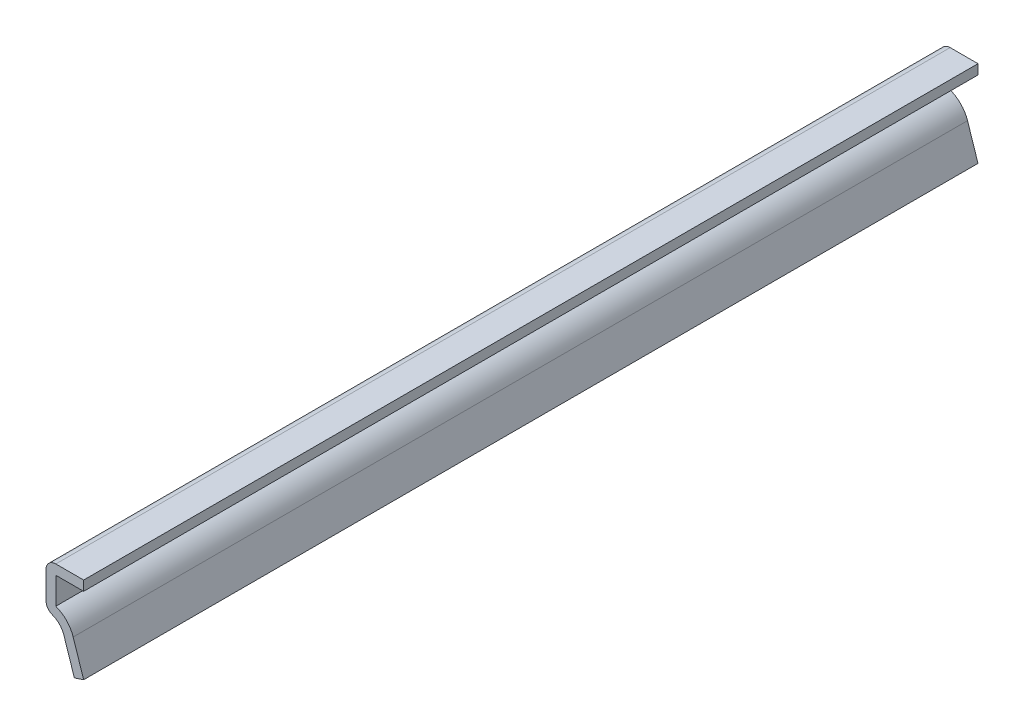
ISO-10303-21;
HEADER;
FILE_DESCRIPTION(('STEP AP214'),'2;1');
FILE_NAME('part.step','',(''),(''),'','','');
FILE_SCHEMA(('AUTOMOTIVE_DESIGN { 1 0 10303 214 1 1 1 1 }'));
ENDSEC;
DATA;
#1=APPLICATION_CONTEXT('core data for automotive mechanical design processes');
#2=APPLICATION_PROTOCOL_DEFINITION('international standard','automotive_design',2000,#1);
#3=PRODUCT_CONTEXT('',#1,'mechanical');
#4=PRODUCT('Part','Part','',(#3));
#5=PRODUCT_RELATED_PRODUCT_CATEGORY('part','',(#4));
#6=PRODUCT_DEFINITION_FORMATION('','',#4);
#7=PRODUCT_DEFINITION_CONTEXT('part definition',#1,'design');
#8=PRODUCT_DEFINITION('design','',#6,#7);
#9=PRODUCT_DEFINITION_SHAPE('','',#8);
#10=(LENGTH_UNIT() NAMED_UNIT(*) SI_UNIT(.MILLI.,.METRE.));
#11=(NAMED_UNIT(*) PLANE_ANGLE_UNIT() SI_UNIT($,.RADIAN.));
#12=(NAMED_UNIT(*) SI_UNIT($,.STERADIAN.) SOLID_ANGLE_UNIT());
#13=UNCERTAINTY_MEASURE_WITH_UNIT(LENGTH_MEASURE(1.E-05),#10,'distance_accuracy_value','');
#14=(GEOMETRIC_REPRESENTATION_CONTEXT(3) GLOBAL_UNCERTAINTY_ASSIGNED_CONTEXT((#13)) GLOBAL_UNIT_ASSIGNED_CONTEXT((#10,
#11,#12)) REPRESENTATION_CONTEXT('',''));
#15=CARTESIAN_POINT('',(0.,0.,0.));
#16=DIRECTION('',(0.,0.,1.));
#17=DIRECTION('',(1.,0.,0.));
#18=AXIS2_PLACEMENT_3D('',#15,#16,#17);
#19=CARTESIAN_POINT('',(-3.33457983918119,5.35953961088337,-150.8125));
#20=DIRECTION('',(-0.94973863332876,-0.313043971931771,0.));
#21=DIRECTION('',(0.313043971931771,-0.94973863332876,0.));
#22=AXIS2_PLACEMENT_3D('',#19,#20,#21);
#23=PLANE('',#22);
#24=DIRECTION('',(0.313043971931771,-0.94973863332876,0.));
#25=VECTOR('',#24,1.);
#26=CARTESIAN_POINT('',(-3.33457983918119,5.35953961088337,0.));
#27=LINE('',#26,#25);
#28=CARTESIAN_POINT('',(-3.33457983918119,5.35953961088337,0.));
#29=VERTEX_POINT('',#28);
#30=CARTESIAN_POINT('',(-1.56801848362578,0.,0.));
#31=VERTEX_POINT('',#30);
#32=EDGE_CURVE('E171',#29,#31,#27,.T.);
#33=ORIENTED_EDGE('',*,*,#32,.F.);
#34=DIRECTION('',(0.,0.,1.));
#35=VECTOR('',#34,1.);
#36=CARTESIAN_POINT('',(-3.33457983918119,5.35953961088337,-150.8125));
#37=LINE('',#36,#35);
#38=CARTESIAN_POINT('',(-3.33457983918119,5.35953961088337,-150.8125));
#39=VERTEX_POINT('',#38);
#40=EDGE_CURVE('E150',#39,#29,#37,.T.);
#41=ORIENTED_EDGE('',*,*,#40,.F.);
#42=DIRECTION('',(0.313043971931771,-0.94973863332876,0.));
#43=VECTOR('',#42,1.);
#44=CARTESIAN_POINT('',(-3.33457983918119,5.35953961088337,-150.8125));
#45=LINE('',#44,#43);
#46=CARTESIAN_POINT('',(-1.56801848362578,0.,-150.8125));
#47=VERTEX_POINT('',#46);
#48=EDGE_CURVE('E130',#39,#47,#45,.T.);
#49=ORIENTED_EDGE('',*,*,#48,.T.);
#50=DIRECTION('',(0.,0.,1.));
#51=VECTOR('',#50,1.);
#52=CARTESIAN_POINT('',(-1.56801848362578,0.,-150.8125));
#53=LINE('',#52,#51);
#54=EDGE_CURVE('E138',#47,#31,#53,.T.);
#55=ORIENTED_EDGE('',*,*,#54,.T.);
#56=EDGE_LOOP('',(#33,#41,#49,#55));
#57=FACE_BOUND('',#56,.T.);
#58=ADVANCED_FACE('F35',(#57),#23,.T.);
#59=CARTESIAN_POINT('',(-6.35,4.365625,-150.8125));
#60=DIRECTION('',(0.,0.,1.));
#61=DIRECTION('',(1.,0.,0.));
#62=AXIS2_PLACEMENT_3D('',#59,#60,#61);
#63=CYLINDRICAL_SURFACE('',#62,3.175);
#64=CARTESIAN_POINT('',(-6.35,4.365625,0.));
#65=DIRECTION('',(0.,0.,-1.));
#66=DIRECTION('',(-1.,0.,0.));
#67=AXIS2_PLACEMENT_3D('',#64,#65,#66);
#68=CIRCLE('',#67,3.175);
#69=CARTESIAN_POINT('',(-5.26381578947368,7.34905069218731,0.));
#70=VERTEX_POINT('',#69);
#71=EDGE_CURVE('E151',#70,#29,#68,.T.);
#72=ORIENTED_EDGE('',*,*,#71,.F.);
#73=DIRECTION('',(0.,0.,1.));
#74=VECTOR('',#73,1.);
#75=CARTESIAN_POINT('',(-5.26381578947368,7.34905069218731,-150.8125));
#76=LINE('',#75,#74);
#77=CARTESIAN_POINT('',(-5.26381578947368,7.34905069218731,-150.8125));
#78=VERTEX_POINT('',#77);
#79=EDGE_CURVE('E58',#70,#78,#76,.F.);
#80=ORIENTED_EDGE('',*,*,#79,.T.);
#81=CARTESIAN_POINT('',(-6.35,4.365625,-150.8125));
#82=DIRECTION('',(0.,0.,-1.));
#83=DIRECTION('',(-1.,0.,0.));
#84=AXIS2_PLACEMENT_3D('',#81,#82,#83);
#85=CIRCLE('',#84,3.175);
#86=EDGE_CURVE('E146',#78,#39,#85,.T.);
#87=ORIENTED_EDGE('',*,*,#86,.T.);
#88=ORIENTED_EDGE('',*,*,#40,.T.);
#89=EDGE_LOOP('',(#72,#80,#87,#88));
#90=FACE_BOUND('',#89,.T.);
#91=ADVANCED_FACE('F225',(#90),#63,.F.);
#92=CARTESIAN_POINT('',(-6.35,15.08125,-150.8125));
#93=DIRECTION('',(-1.,0.,0.));
#94=DIRECTION('',(0.,0.,1.));
#95=AXIS2_PLACEMENT_3D('',#92,#93,#94);
#96=PLANE('',#95);
#97=DIRECTION('',(0.,-1.,0.));
#98=VECTOR('',#97,1.);
#99=CARTESIAN_POINT('',(-6.35,15.08125,-150.8125));
#100=LINE('',#99,#98);
#101=CARTESIAN_POINT('',(-6.35,13.43025,-150.8125));
#102=VERTEX_POINT('',#101);
#103=CARTESIAN_POINT('',(-6.35,8.90043205212471,-150.8125));
#104=VERTEX_POINT('',#103);
#105=EDGE_CURVE('E167',#102,#104,#100,.T.);
#106=ORIENTED_EDGE('',*,*,#105,.T.);
#107=DIRECTION('',(0.,0.,1.));
#108=VECTOR('',#107,1.);
#109=CARTESIAN_POINT('',(-6.35,8.90043205212471,-150.8125));
#110=LINE('',#109,#108);
#111=CARTESIAN_POINT('',(-6.35,8.90043205212471,0.));
#112=VERTEX_POINT('',#111);
#113=EDGE_CURVE('E207',#104,#112,#110,.T.);
#114=ORIENTED_EDGE('',*,*,#113,.T.);
#115=DIRECTION('',(0.,-1.,0.));
#116=VECTOR('',#115,1.);
#117=CARTESIAN_POINT('',(-6.35,15.08125,0.));
#118=LINE('',#117,#116);
#119=CARTESIAN_POINT('',(-6.35,13.43025,0.));
#120=VERTEX_POINT('',#119);
#121=EDGE_CURVE('E153',#120,#112,#118,.T.);
#122=ORIENTED_EDGE('',*,*,#121,.F.);
#123=DIRECTION('',(0.,0.,1.));
#124=VECTOR('',#123,1.);
#125=CARTESIAN_POINT('',(-6.35,13.43025,-150.8125));
#126=LINE('',#125,#124);
#127=EDGE_CURVE('E190',#120,#102,#126,.F.);
#128=ORIENTED_EDGE('',*,*,#127,.T.);
#129=EDGE_LOOP('',(#106,#114,#122,#128));
#130=FACE_BOUND('',#129,.T.);
#131=ADVANCED_FACE('F219',(#130),#96,.T.);
#132=CARTESIAN_POINT('',(0.,15.08125,-150.8125));
#133=DIRECTION('',(0.,1.,0.));
#134=DIRECTION('',(0.,0.,1.));
#135=AXIS2_PLACEMENT_3D('',#132,#133,#134);
#136=PLANE('',#135);
#137=DIRECTION('',(-1.,0.,0.));
#138=VECTOR('',#137,1.);
#139=CARTESIAN_POINT('',(0.,15.08125,-150.8125));
#140=LINE('',#139,#138);
#141=CARTESIAN_POINT('',(0.,15.08125,-150.8125));
#142=VERTEX_POINT('',#141);
#143=CARTESIAN_POINT('',(-4.699,15.08125,-150.8125));
#144=VERTEX_POINT('',#143);
#145=EDGE_CURVE('E165',#142,#144,#140,.T.);
#146=ORIENTED_EDGE('',*,*,#145,.T.);
#147=DIRECTION('',(0.,0.,1.));
#148=VECTOR('',#147,1.);
#149=CARTESIAN_POINT('',(-4.699,15.08125,-150.8125));
#150=LINE('',#149,#148);
#151=CARTESIAN_POINT('',(-4.699,15.08125,0.));
#152=VERTEX_POINT('',#151);
#153=EDGE_CURVE('E11',#144,#152,#150,.T.);
#154=ORIENTED_EDGE('',*,*,#153,.T.);
#155=DIRECTION('',(-1.,0.,0.));
#156=VECTOR('',#155,1.);
#157=CARTESIAN_POINT('',(0.,15.08125,0.));
#158=LINE('',#157,#156);
#159=CARTESIAN_POINT('',(0.,15.08125,0.));
#160=VERTEX_POINT('',#159);
#161=EDGE_CURVE('E184',#160,#152,#158,.T.);
#162=ORIENTED_EDGE('',*,*,#161,.F.);
#163=DIRECTION('',(0.,0.,1.));
#164=VECTOR('',#163,1.);
#165=CARTESIAN_POINT('',(0.,15.08125,-150.8125));
#166=LINE('',#165,#164);
#167=EDGE_CURVE('E191',#142,#160,#166,.T.);
#168=ORIENTED_EDGE('',*,*,#167,.F.);
#169=EDGE_LOOP('',(#146,#154,#162,#168));
#170=FACE_BOUND('',#169,.T.);
#171=ADVANCED_FACE('F251',(#170),#136,.T.);
#172=CARTESIAN_POINT('',(0.,15.08125,-150.8125));
#173=DIRECTION('',(-1.,0.,0.));
#174=DIRECTION('',(0.,0.,1.));
#175=AXIS2_PLACEMENT_3D('',#172,#173,#174);
#176=PLANE('',#175);
#177=DIRECTION('',(0.,-1.,0.));
#178=VECTOR('',#177,1.);
#179=CARTESIAN_POINT('',(0.,15.08125,0.));
#180=LINE('',#179,#178);
#181=CARTESIAN_POINT('',(0.,13.43025,0.));
#182=VERTEX_POINT('',#181);
#183=EDGE_CURVE('E182',#160,#182,#180,.T.);
#184=ORIENTED_EDGE('',*,*,#183,.T.);
#185=DIRECTION('',(0.,0.,1.));
#186=VECTOR('',#185,1.);
#187=CARTESIAN_POINT('',(0.,13.43025,-150.8125));
#188=LINE('',#187,#186);
#189=CARTESIAN_POINT('',(0.,13.43025,-150.8125));
#190=VERTEX_POINT('',#189);
#191=EDGE_CURVE('E193',#190,#182,#188,.T.);
#192=ORIENTED_EDGE('',*,*,#191,.F.);
#193=DIRECTION('',(0.,-1.,0.));
#194=VECTOR('',#193,1.);
#195=CARTESIAN_POINT('',(0.,15.08125,-150.8125));
#196=LINE('',#195,#194);
#197=EDGE_CURVE('E163',#142,#190,#196,.T.);
#198=ORIENTED_EDGE('',*,*,#197,.F.);
#199=ORIENTED_EDGE('',*,*,#167,.T.);
#200=EDGE_LOOP('',(#184,#192,#198,#199));
#201=FACE_BOUND('',#200,.T.);
#202=ADVANCED_FACE('F249',(#201),#176,.F.);
#203=CARTESIAN_POINT('',(0.,13.43025,-150.8125));
#204=DIRECTION('',(0.,1.,0.));
#205=DIRECTION('',(0.,0.,1.));
#206=AXIS2_PLACEMENT_3D('',#203,#204,#205);
#207=PLANE('',#206);
#208=DIRECTION('',(1.,0.,0.));
#209=VECTOR('',#208,1.);
#210=CARTESIAN_POINT('',(0.,13.43025,0.));
#211=LINE('',#210,#209);
#212=CARTESIAN_POINT('',(-4.699,13.43025,0.));
#213=VERTEX_POINT('',#212);
#214=EDGE_CURVE('E180',#182,#213,#211,.F.);
#215=ORIENTED_EDGE('',*,*,#214,.T.);
#216=DIRECTION('',(0.,0.,1.));
#217=VECTOR('',#216,1.);
#218=CARTESIAN_POINT('',(-4.699,13.43025,-150.8125));
#219=LINE('',#218,#217);
#220=CARTESIAN_POINT('',(-4.699,13.43025,-150.8125));
#221=VERTEX_POINT('',#220);
#222=EDGE_CURVE('E196',#221,#213,#219,.T.);
#223=ORIENTED_EDGE('',*,*,#222,.F.);
#224=DIRECTION('',(1.,0.,0.));
#225=VECTOR('',#224,1.);
#226=CARTESIAN_POINT('',(0.,13.43025,-150.8125));
#227=LINE('',#226,#225);
#228=EDGE_CURVE('E161',#190,#221,#227,.F.);
#229=ORIENTED_EDGE('',*,*,#228,.F.);
#230=ORIENTED_EDGE('',*,*,#191,.T.);
#231=EDGE_LOOP('',(#215,#223,#229,#230));
#232=FACE_BOUND('',#231,.T.);
#233=ADVANCED_FACE('F244',(#232),#207,.F.);
#234=CARTESIAN_POINT('',(-4.699,15.08125,-150.8125));
#235=DIRECTION('',(-1.,0.,0.));
#236=DIRECTION('',(0.,0.,1.));
#237=AXIS2_PLACEMENT_3D('',#234,#235,#236);
#238=PLANE('',#237);
#239=DIRECTION('',(0.,1.,0.));
#240=VECTOR('',#239,1.);
#241=CARTESIAN_POINT('',(-4.699,15.08125,0.));
#242=LINE('',#241,#240);
#243=CARTESIAN_POINT('',(-4.699,8.90043205212471,0.));
#244=VERTEX_POINT('',#243);
#245=EDGE_CURVE('E178',#213,#244,#242,.F.);
#246=ORIENTED_EDGE('',*,*,#245,.T.);
#247=DIRECTION('',(0.,0.,1.));
#248=VECTOR('',#247,1.);
#249=CARTESIAN_POINT('',(-4.699,8.90043205212471,-150.8125));
#250=LINE('',#249,#248);
#251=CARTESIAN_POINT('',(-4.699,8.90043205212471,-150.8125));
#252=VERTEX_POINT('',#251);
#253=EDGE_CURVE('E199',#252,#244,#250,.T.);
#254=ORIENTED_EDGE('',*,*,#253,.F.);
#255=DIRECTION('',(0.,1.,0.));
#256=VECTOR('',#255,1.);
#257=CARTESIAN_POINT('',(-4.699,15.08125,-150.8125));
#258=LINE('',#257,#256);
#259=EDGE_CURVE('E159',#221,#252,#258,.F.);
#260=ORIENTED_EDGE('',*,*,#259,.F.);
#261=ORIENTED_EDGE('',*,*,#222,.T.);
#262=EDGE_LOOP('',(#246,#254,#260,#261));
#263=FACE_BOUND('',#262,.T.);
#264=ADVANCED_FACE('F238',(#263),#238,.F.);
#265=CARTESIAN_POINT('',(-6.35,4.365625,-150.8125));
#266=DIRECTION('',(0.,0.,1.));
#267=DIRECTION('',(1.,0.,0.));
#268=AXIS2_PLACEMENT_3D('',#265,#266,#267);
#269=CYLINDRICAL_SURFACE('',#268,4.826);
#270=CARTESIAN_POINT('',(-6.35,4.365625,0.));
#271=DIRECTION('',(0.,0.,1.));
#272=DIRECTION('',(1.,0.,0.));
#273=AXIS2_PLACEMENT_3D('',#270,#271,#272);
#274=CIRCLE('',#273,4.826);
#275=CARTESIAN_POINT('',(-1.76656135555541,5.87637520854273,0.));
#276=VERTEX_POINT('',#275);
#277=EDGE_CURVE('E176',#244,#276,#274,.F.);
#278=ORIENTED_EDGE('',*,*,#277,.T.);
#279=DIRECTION('',(0.,0.,1.));
#280=VECTOR('',#279,1.);
#281=CARTESIAN_POINT('',(-1.76656135555541,5.87637520854273,-150.8125));
#282=LINE('',#281,#280);
#283=CARTESIAN_POINT('',(-1.76656135555541,5.87637520854273,-150.8125));
#284=VERTEX_POINT('',#283);
#285=EDGE_CURVE('E202',#284,#276,#282,.T.);
#286=ORIENTED_EDGE('',*,*,#285,.F.);
#287=CARTESIAN_POINT('',(-6.35,4.365625,-150.8125));
#288=DIRECTION('',(0.,0.,1.));
#289=DIRECTION('',(1.,0.,0.));
#290=AXIS2_PLACEMENT_3D('',#287,#288,#289);
#291=CIRCLE('',#290,4.826);
#292=EDGE_CURVE('E157',#252,#284,#291,.F.);
#293=ORIENTED_EDGE('',*,*,#292,.F.);
#294=ORIENTED_EDGE('',*,*,#253,.T.);
#295=EDGE_LOOP('',(#278,#286,#293,#294));
#296=FACE_BOUND('',#295,.T.);
#297=ADVANCED_FACE('F234',(#296),#269,.T.);
#298=CARTESIAN_POINT('',(-1.7665613555554,5.87637520854273,-150.8125));
#299=DIRECTION('',(-0.94973863332876,-0.313043971931771,0.));
#300=DIRECTION('',(0.313043971931771,-0.94973863332876,0.));
#301=AXIS2_PLACEMENT_3D('',#298,#299,#300);
#302=PLANE('',#301);
#303=DIRECTION('',(0.313043971931771,-0.94973863332876,0.));
#304=VECTOR('',#303,1.);
#305=CARTESIAN_POINT('',(-1.7665613555554,5.87637520854273,0.));
#306=LINE('',#305,#304);
#307=CARTESIAN_POINT('',(0.,0.516835597659354,0.));
#308=VERTEX_POINT('',#307);
#309=EDGE_CURVE('E174',#276,#308,#306,.T.);
#310=ORIENTED_EDGE('',*,*,#309,.T.);
#311=DIRECTION('',(0.,0.,1.));
#312=VECTOR('',#311,1.);
#313=CARTESIAN_POINT('',(0.,0.516835597659354,-150.8125));
#314=LINE('',#313,#312);
#315=CARTESIAN_POINT('',(0.,0.516835597659354,-150.8125));
#316=VERTEX_POINT('',#315);
#317=EDGE_CURVE('E145',#316,#308,#314,.T.);
#318=ORIENTED_EDGE('',*,*,#317,.F.);
#319=DIRECTION('',(0.313043971931771,-0.94973863332876,0.));
#320=VECTOR('',#319,1.);
#321=CARTESIAN_POINT('',(-1.7665613555554,5.87637520854273,-150.8125));
#322=LINE('',#321,#320);
#323=EDGE_CURVE('E132',#284,#316,#322,.T.);
#324=ORIENTED_EDGE('',*,*,#323,.F.);
#325=ORIENTED_EDGE('',*,*,#285,.T.);
#326=EDGE_LOOP('',(#310,#318,#324,#325));
#327=FACE_BOUND('',#326,.T.);
#328=ADVANCED_FACE('F230',(#327),#302,.F.);
#329=CARTESIAN_POINT('',(0.,0.516835597659354,-150.8125));
#330=DIRECTION('',(-0.313043971931771,0.94973863332876,0.));
#331=DIRECTION('',(-0.94973863332876,-0.313043971931771,0.));
#332=AXIS2_PLACEMENT_3D('',#329,#330,#331);
#333=PLANE('',#332);
#334=DIRECTION('',(-0.94973863332876,-0.313043971931771,0.));
#335=VECTOR('',#334,1.);
#336=CARTESIAN_POINT('',(0.,0.516835597659354,0.));
#337=LINE('',#336,#335);
#338=EDGE_CURVE('E141',#308,#31,#337,.T.);
#339=ORIENTED_EDGE('',*,*,#338,.T.);
#340=ORIENTED_EDGE('',*,*,#54,.F.);
#341=DIRECTION('',(-0.94973863332876,-0.313043971931771,0.));
#342=VECTOR('',#341,1.);
#343=CARTESIAN_POINT('',(0.,0.516835597659354,-150.8125));
#344=LINE('',#343,#342);
#345=EDGE_CURVE('E126',#316,#47,#344,.T.);
#346=ORIENTED_EDGE('',*,*,#345,.F.);
#347=ORIENTED_EDGE('',*,*,#317,.T.);
#348=EDGE_LOOP('',(#339,#340,#346,#347));
#349=FACE_BOUND('',#348,.T.);
#350=ADVANCED_FACE('F139',(#349),#333,.F.);
#351=CARTESIAN_POINT('',(-6.35,4.365625,-150.8125));
#352=DIRECTION('',(0.,0.,1.));
#353=DIRECTION('',(1.,0.,0.));
#354=AXIS2_PLACEMENT_3D('',#351,#352,#353);
#355=PLANE('',#354);
#356=ORIENTED_EDGE('',*,*,#86,.F.);
#357=CARTESIAN_POINT('',(-4.699,8.90043205212471,-150.8125));
#358=DIRECTION('',(0.,0.,1.));
#359=DIRECTION('',(1.,0.,0.));
#360=AXIS2_PLACEMENT_3D('',#357,#358,#359);
#361=CIRCLE('',#360,1.651);
#362=EDGE_CURVE('E43',#78,#104,#361,.F.);
#363=ORIENTED_EDGE('',*,*,#362,.T.);
#364=ORIENTED_EDGE('',*,*,#105,.F.);
#365=CARTESIAN_POINT('',(-4.699,13.43025,-150.8125));
#366=DIRECTION('',(0.,0.,1.));
#367=DIRECTION('',(1.,0.,0.));
#368=AXIS2_PLACEMENT_3D('',#365,#366,#367);
#369=CIRCLE('',#368,1.651);
#370=EDGE_CURVE('E50',#102,#144,#369,.F.);
#371=ORIENTED_EDGE('',*,*,#370,.T.);
#372=ORIENTED_EDGE('',*,*,#145,.F.);
#373=ORIENTED_EDGE('',*,*,#197,.T.);
#374=ORIENTED_EDGE('',*,*,#228,.T.);
#375=ORIENTED_EDGE('',*,*,#259,.T.);
#376=ORIENTED_EDGE('',*,*,#292,.T.);
#377=ORIENTED_EDGE('',*,*,#323,.T.);
#378=ORIENTED_EDGE('',*,*,#345,.T.);
#379=ORIENTED_EDGE('',*,*,#48,.F.);
#380=EDGE_LOOP('',(#356,#363,#364,#371,#372,#373,#374,#375,#376,#377,#378,#379));
#381=FACE_BOUND('',#380,.T.);
#382=ADVANCED_FACE('F128',(#381),#355,.F.);
#383=CARTESIAN_POINT('',(-6.35,4.365625,0.));
#384=DIRECTION('',(0.,0.,1.));
#385=DIRECTION('',(1.,0.,0.));
#386=AXIS2_PLACEMENT_3D('',#383,#384,#385);
#387=PLANE('',#386);
#388=ORIENTED_EDGE('',*,*,#121,.T.);
#389=CARTESIAN_POINT('',(-4.699,8.90043205212471,0.));
#390=DIRECTION('',(0.,0.,1.));
#391=DIRECTION('',(1.,0.,0.));
#392=AXIS2_PLACEMENT_3D('',#389,#390,#391);
#393=CIRCLE('',#392,1.651);
#394=EDGE_CURVE('E212',#112,#70,#393,.T.);
#395=ORIENTED_EDGE('',*,*,#394,.T.);
#396=ORIENTED_EDGE('',*,*,#71,.T.);
#397=ORIENTED_EDGE('',*,*,#32,.T.);
#398=ORIENTED_EDGE('',*,*,#338,.F.);
#399=ORIENTED_EDGE('',*,*,#309,.F.);
#400=ORIENTED_EDGE('',*,*,#277,.F.);
#401=ORIENTED_EDGE('',*,*,#245,.F.);
#402=ORIENTED_EDGE('',*,*,#214,.F.);
#403=ORIENTED_EDGE('',*,*,#183,.F.);
#404=ORIENTED_EDGE('',*,*,#161,.T.);
#405=CARTESIAN_POINT('',(-4.699,13.43025,0.));
#406=DIRECTION('',(0.,0.,1.));
#407=DIRECTION('',(1.,0.,0.));
#408=AXIS2_PLACEMENT_3D('',#405,#406,#407);
#409=CIRCLE('',#408,1.651);
#410=EDGE_CURVE('E210',#152,#120,#409,.T.);
#411=ORIENTED_EDGE('',*,*,#410,.T.);
#412=EDGE_LOOP('',(#388,#395,#396,#397,#398,#399,#400,#401,#402,#403,#404,#411));
#413=FACE_BOUND('',#412,.T.);
#414=ADVANCED_FACE('F224',(#413),#387,.T.);
#415=CARTESIAN_POINT('',(-4.699,8.90043205212471,-150.8125));
#416=DIRECTION('',(0.,0.,1.));
#417=DIRECTION('',(1.,0.,0.));
#418=AXIS2_PLACEMENT_3D('',#415,#416,#417);
#419=CYLINDRICAL_SURFACE('',#418,1.651);
#420=ORIENTED_EDGE('',*,*,#362,.F.);
#421=ORIENTED_EDGE('',*,*,#79,.F.);
#422=ORIENTED_EDGE('',*,*,#394,.F.);
#423=ORIENTED_EDGE('',*,*,#113,.F.);
#424=EDGE_LOOP('',(#420,#421,#422,#423));
#425=FACE_BOUND('',#424,.T.);
#426=ADVANCED_FACE('F222',(#425),#419,.T.);
#427=CARTESIAN_POINT('',(-4.699,13.43025,-150.8125));
#428=DIRECTION('',(0.,0.,1.));
#429=DIRECTION('',(1.,0.,0.));
#430=AXIS2_PLACEMENT_3D('',#427,#428,#429);
#431=CYLINDRICAL_SURFACE('',#430,1.651);
#432=ORIENTED_EDGE('',*,*,#370,.F.);
#433=ORIENTED_EDGE('',*,*,#127,.F.);
#434=ORIENTED_EDGE('',*,*,#410,.F.);
#435=ORIENTED_EDGE('',*,*,#153,.F.);
#436=EDGE_LOOP('',(#432,#433,#434,#435));
#437=FACE_BOUND('',#436,.T.);
#438=ADVANCED_FACE('F37',(#437),#431,.T.);
#439=CLOSED_SHELL('',(#58,#91,#131,#171,#202,#233,#264,#297,#328,#350,#382,#414,#426,#438));
#440=MANIFOLD_SOLID_BREP('B2',#439);
#441=ADVANCED_BREP_SHAPE_REPRESENTATION('',(#18,#440),#14);
#442=SHAPE_DEFINITION_REPRESENTATION(#9,#441);
ENDSEC;
END-ISO-10303-21;
